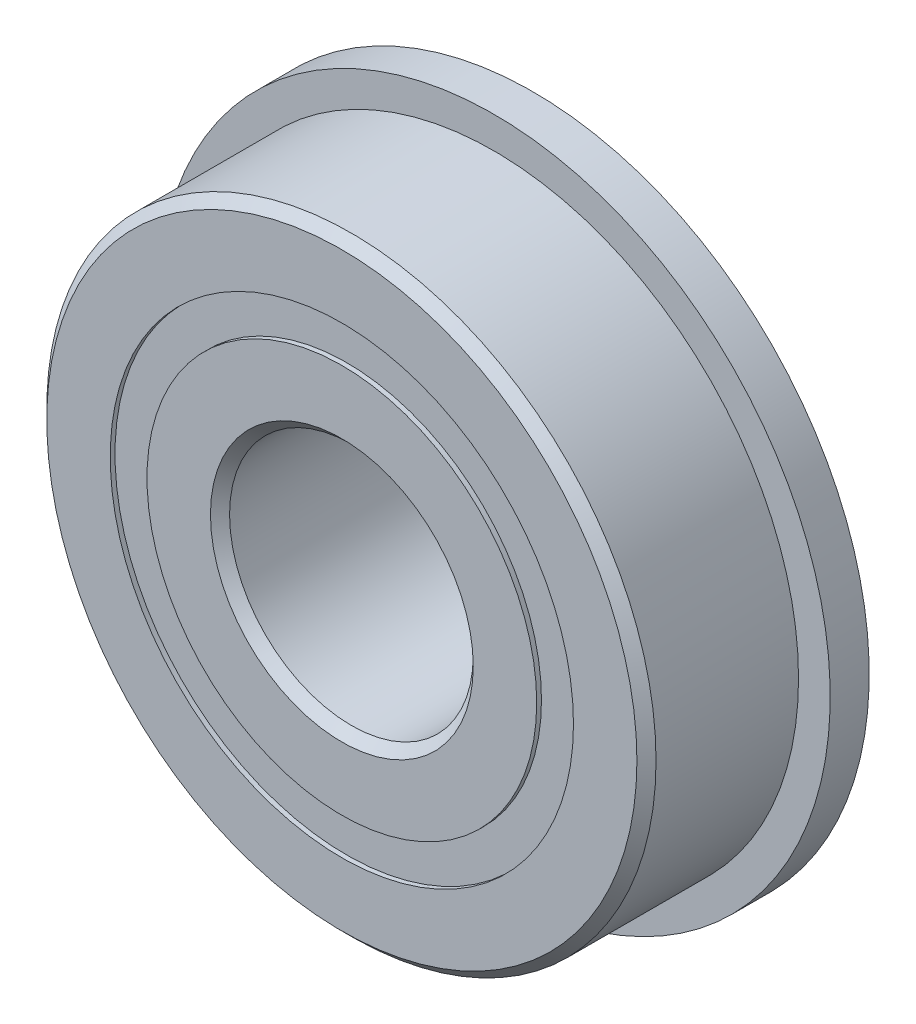
ISO-10303-21;
HEADER;
FILE_DESCRIPTION(('STEP AP214'),'2;1');
FILE_NAME('part.step','',(''),(''),'','','');
FILE_SCHEMA(('AUTOMOTIVE_DESIGN { 1 0 10303 214 1 1 1 1 }'));
ENDSEC;
DATA;
#1=APPLICATION_CONTEXT('core data for automotive mechanical design processes');
#2=APPLICATION_PROTOCOL_DEFINITION('international standard','automotive_design',2000,#1);
#3=PRODUCT_CONTEXT('',#1,'mechanical');
#4=PRODUCT('Part','Part','',(#3));
#5=PRODUCT_RELATED_PRODUCT_CATEGORY('part','',(#4));
#6=PRODUCT_DEFINITION_FORMATION('','',#4);
#7=PRODUCT_DEFINITION_CONTEXT('part definition',#1,'design');
#8=PRODUCT_DEFINITION('design','',#6,#7);
#9=PRODUCT_DEFINITION_SHAPE('','',#8);
#10=(LENGTH_UNIT() NAMED_UNIT(*) SI_UNIT(.MILLI.,.METRE.));
#11=(NAMED_UNIT(*) PLANE_ANGLE_UNIT() SI_UNIT($,.RADIAN.));
#12=(NAMED_UNIT(*) SI_UNIT($,.STERADIAN.) SOLID_ANGLE_UNIT());
#13=UNCERTAINTY_MEASURE_WITH_UNIT(LENGTH_MEASURE(1.E-05),#10,'distance_accuracy_value','');
#14=(GEOMETRIC_REPRESENTATION_CONTEXT(3) GLOBAL_UNCERTAINTY_ASSIGNED_CONTEXT((#13)) GLOBAL_UNIT_ASSIGNED_CONTEXT((#10,
#11,#12)) REPRESENTATION_CONTEXT('',''));
#15=CARTESIAN_POINT('',(0.,0.,0.));
#16=DIRECTION('',(0.,0.,1.));
#17=DIRECTION('',(1.,0.,0.));
#18=AXIS2_PLACEMENT_3D('',#15,#16,#17);
#19=CARTESIAN_POINT('',(0.,6.03522142857143,-2.36474));
#20=DIRECTION('',(0.,0.,1.));
#21=DIRECTION('',(1.,0.,0.));
#22=AXIS2_PLACEMENT_3D('',#19,#20,#21);
#23=PLANE('',#22);
#24=CARTESIAN_POINT('',(0.,0.,-2.36474));
#25=DIRECTION('',(0.,0.,1.));
#26=DIRECTION('',(1.,0.,0.));
#27=AXIS2_PLACEMENT_3D('',#24,#25,#26);
#28=CIRCLE('',#27,6.03522142857143);
#29=CARTESIAN_POINT('',(6.03522142857143,0.,-2.36474));
#30=VERTEX_POINT('',#29);
#31=EDGE_CURVE('E55',#30,#30,#28,.T.);
#32=ORIENTED_EDGE('',*,*,#31,.F.);
#33=EDGE_LOOP('',(#32));
#34=FACE_BOUND('',#33,.T.);
#35=CARTESIAN_POINT('',(0.,0.,-2.36474));
#36=DIRECTION('',(0.,0.,1.));
#37=DIRECTION('',(1.,0.,0.));
#38=AXIS2_PLACEMENT_3D('',#35,#36,#37);
#39=CIRCLE('',#38,5.07727857142857);
#40=CARTESIAN_POINT('',(5.07727857142857,0.,-2.36474));
#41=VERTEX_POINT('',#40);
#42=EDGE_CURVE('E11',#41,#41,#39,.T.);
#43=ORIENTED_EDGE('',*,*,#42,.T.);
#44=EDGE_LOOP('',(#43));
#45=FACE_BOUND('',#44,.T.);
#46=ADVANCED_FACE('F41',(#34,#45),#23,.F.);
#47=CARTESIAN_POINT('',(0.,0.,2.4892));
#48=DIRECTION('',(0.,0.,1.));
#49=DIRECTION('',(1.,0.,0.));
#50=AXIS2_PLACEMENT_3D('',#47,#48,#49);
#51=CYLINDRICAL_SURFACE('',#50,5.07727857142857);
#52=ORIENTED_EDGE('',*,*,#42,.F.);
#53=EDGE_LOOP('',(#52));
#54=FACE_BOUND('',#53,.T.);
#55=CARTESIAN_POINT('',(0.,0.,-1.20554465033679));
#56=DIRECTION('',(0.,0.,1.));
#57=DIRECTION('',(1.,0.,0.));
#58=AXIS2_PLACEMENT_3D('',#55,#56,#57);
#59=CIRCLE('',#58,5.07727857142857);
#60=CARTESIAN_POINT('',(5.07727857142857,0.,-1.20554465033679));
#61=VERTEX_POINT('',#60);
#62=EDGE_CURVE('E47',#61,#61,#59,.T.);
#63=ORIENTED_EDGE('',*,*,#62,.T.);
#64=EDGE_LOOP('',(#63));
#65=FACE_BOUND('',#64,.T.);
#66=ADVANCED_FACE('F64',(#54,#65),#51,.F.);
#67=CARTESIAN_POINT('',(0.,6.03522142857143,-1.20554465033679));
#68=DIRECTION('',(0.,0.,-1.));
#69=DIRECTION('',(-1.,0.,0.));
#70=AXIS2_PLACEMENT_3D('',#67,#68,#69);
#71=PLANE('',#70);
#72=ORIENTED_EDGE('',*,*,#62,.F.);
#73=EDGE_LOOP('',(#72));
#74=FACE_BOUND('',#73,.T.);
#75=CARTESIAN_POINT('',(0.,0.,-1.20554465033679));
#76=DIRECTION('',(0.,0.,1.));
#77=DIRECTION('',(1.,0.,0.));
#78=AXIS2_PLACEMENT_3D('',#75,#76,#77);
#79=CIRCLE('',#78,6.03522142857143);
#80=CARTESIAN_POINT('',(6.03522142857143,0.,-1.20554465033679));
#81=VERTEX_POINT('',#80);
#82=EDGE_CURVE('E51',#81,#81,#79,.T.);
#83=ORIENTED_EDGE('',*,*,#82,.T.);
#84=EDGE_LOOP('',(#83));
#85=FACE_BOUND('',#84,.T.);
#86=ADVANCED_FACE('F68',(#74,#85),#71,.F.);
#87=CARTESIAN_POINT('',(0.,0.,2.4892));
#88=DIRECTION('',(0.,0.,1.));
#89=DIRECTION('',(1.,0.,0.));
#90=AXIS2_PLACEMENT_3D('',#87,#88,#89);
#91=CYLINDRICAL_SURFACE('',#90,6.03522142857143);
#92=ORIENTED_EDGE('',*,*,#82,.F.);
#93=EDGE_LOOP('',(#92));
#94=FACE_BOUND('',#93,.T.);
#95=ORIENTED_EDGE('',*,*,#31,.T.);
#96=EDGE_LOOP('',(#95));
#97=FACE_BOUND('',#96,.T.);
#98=ADVANCED_FACE('F61',(#94,#97),#91,.T.);
#99=CLOSED_SHELL('',(#46,#66,#86,#98));
#100=MANIFOLD_SOLID_BREP('B2',#99);
#101=CARTESIAN_POINT('',(0.,6.03522142857143,2.36474));
#102=DIRECTION('',(0.,0.,-1.));
#103=DIRECTION('',(-1.,0.,0.));
#104=AXIS2_PLACEMENT_3D('',#101,#102,#103);
#105=PLANE('',#104);
#106=CARTESIAN_POINT('',(0.,0.,2.36474));
#107=DIRECTION('',(0.,0.,1.));
#108=DIRECTION('',(1.,0.,0.));
#109=AXIS2_PLACEMENT_3D('',#106,#107,#108);
#110=CIRCLE('',#109,5.07727857142857);
#111=CARTESIAN_POINT('',(5.07727857142857,0.,2.36474));
#112=VERTEX_POINT('',#111);
#113=EDGE_CURVE('E40',#112,#112,#110,.T.);
#114=ORIENTED_EDGE('',*,*,#113,.F.);
#115=EDGE_LOOP('',(#114));
#116=FACE_BOUND('',#115,.T.);
#117=CARTESIAN_POINT('',(0.,0.,2.36474));
#118=DIRECTION('',(0.,0.,1.));
#119=DIRECTION('',(1.,0.,0.));
#120=AXIS2_PLACEMENT_3D('',#117,#118,#119);
#121=CIRCLE('',#120,6.03522142857143);
#122=CARTESIAN_POINT('',(6.03522142857143,0.,2.36474));
#123=VERTEX_POINT('',#122);
#124=EDGE_CURVE('E122',#123,#123,#121,.T.);
#125=ORIENTED_EDGE('',*,*,#124,.T.);
#126=EDGE_LOOP('',(#125));
#127=FACE_BOUND('',#126,.T.);
#128=ADVANCED_FACE('F108',(#116,#127),#105,.F.);
#129=CARTESIAN_POINT('',(0.,0.,2.4892));
#130=DIRECTION('',(0.,0.,1.));
#131=DIRECTION('',(1.,0.,0.));
#132=AXIS2_PLACEMENT_3D('',#129,#130,#131);
#133=CYLINDRICAL_SURFACE('',#132,5.07727857142857);
#134=CARTESIAN_POINT('',(0.,0.,1.20554465033679));
#135=DIRECTION('',(0.,0.,1.));
#136=DIRECTION('',(1.,0.,0.));
#137=AXIS2_PLACEMENT_3D('',#134,#135,#136);
#138=CIRCLE('',#137,5.07727857142857);
#139=CARTESIAN_POINT('',(5.07727857142857,0.,1.20554465033679));
#140=VERTEX_POINT('',#139);
#141=EDGE_CURVE('E114',#140,#140,#138,.T.);
#142=ORIENTED_EDGE('',*,*,#141,.F.);
#143=EDGE_LOOP('',(#142));
#144=FACE_BOUND('',#143,.T.);
#145=ORIENTED_EDGE('',*,*,#113,.T.);
#146=EDGE_LOOP('',(#145));
#147=FACE_BOUND('',#146,.T.);
#148=ADVANCED_FACE('F137',(#144,#147),#133,.F.);
#149=CARTESIAN_POINT('',(0.,6.03522142857143,1.20554465033679));
#150=DIRECTION('',(0.,0.,1.));
#151=DIRECTION('',(1.,0.,0.));
#152=AXIS2_PLACEMENT_3D('',#149,#150,#151);
#153=PLANE('',#152);
#154=CARTESIAN_POINT('',(0.,0.,1.20554465033679));
#155=DIRECTION('',(0.,0.,1.));
#156=DIRECTION('',(1.,0.,0.));
#157=AXIS2_PLACEMENT_3D('',#154,#155,#156);
#158=CIRCLE('',#157,6.03522142857143);
#159=CARTESIAN_POINT('',(6.03522142857143,0.,1.20554465033679));
#160=VERTEX_POINT('',#159);
#161=EDGE_CURVE('E118',#160,#160,#158,.T.);
#162=ORIENTED_EDGE('',*,*,#161,.F.);
#163=EDGE_LOOP('',(#162));
#164=FACE_BOUND('',#163,.T.);
#165=ORIENTED_EDGE('',*,*,#141,.T.);
#166=EDGE_LOOP('',(#165));
#167=FACE_BOUND('',#166,.T.);
#168=ADVANCED_FACE('F132',(#164,#167),#153,.F.);
#169=CARTESIAN_POINT('',(0.,0.,2.4892));
#170=DIRECTION('',(0.,0.,1.));
#171=DIRECTION('',(1.,0.,0.));
#172=AXIS2_PLACEMENT_3D('',#169,#170,#171);
#173=CYLINDRICAL_SURFACE('',#172,6.03522142857143);
#174=ORIENTED_EDGE('',*,*,#124,.F.);
#175=EDGE_LOOP('',(#174));
#176=FACE_BOUND('',#175,.T.);
#177=ORIENTED_EDGE('',*,*,#161,.T.);
#178=EDGE_LOOP('',(#177));
#179=FACE_BOUND('',#178,.T.);
#180=ADVANCED_FACE('F129',(#176,#179),#173,.T.);
#181=CLOSED_SHELL('',(#128,#148,#168,#180));
#182=MANIFOLD_SOLID_BREP('B6',#181);
#183=CARTESIAN_POINT('',(-2.41076652547187,5.00600827228285,0.));
#184=DIRECTION('',(0.,0.,1.));
#185=DIRECTION('',(-0.433883739117546,0.900968867902425,0.));
#186=AXIS2_PLACEMENT_3D('',#183,#184,#185);
#187=SPHERICAL_SURFACE('',#186,1.20554465033679);
#188=CARTESIAN_POINT('',(-2.41076652547187,5.00600827228285,1.20554465033679));
#189=VERTEX_POINT('',#188);
#190=VERTEX_LOOP('',#189);
#191=FACE_BOUND('',#190,.T.);
#192=ADVANCED_FACE('F175',(#191),#187,.T.);
#193=CLOSED_SHELL('',(#192));
#194=MANIFOLD_SOLID_BREP('B35',#193);
#195=CARTESIAN_POINT('',(-4.34405117446295,3.46426521157764,0.));
#196=DIRECTION('',(0.,0.,1.));
#197=DIRECTION('',(-0.781831482468022,0.623489801858743,0.));
#198=AXIS2_PLACEMENT_3D('',#195,#196,#197);
#199=SPHERICAL_SURFACE('',#198,1.20554465033679);
#200=CARTESIAN_POINT('',(-4.34405117446295,3.46426521157764,1.20554465033679));
#201=VERTEX_POINT('',#200);
#202=VERTEX_LOOP('',#201);
#203=FACE_BOUND('',#202,.T.);
#204=ADVANCED_FACE('F195',(#203),#199,.T.);
#205=CLOSED_SHELL('',(#204));
#206=MANIFOLD_SOLID_BREP('B104',#205);
#207=CARTESIAN_POINT('',(-5.41694321206024,1.23638193929483,0.));
#208=DIRECTION('',(0.,0.,1.));
#209=DIRECTION('',(-0.974927912181821,0.222520933956325,0.));
#210=AXIS2_PLACEMENT_3D('',#207,#208,#209);
#211=SPHERICAL_SURFACE('',#210,1.20554465033679);
#212=CARTESIAN_POINT('',(-5.41694321206024,1.23638193929483,1.20554465033679));
#213=VERTEX_POINT('',#212);
#214=VERTEX_LOOP('',#213);
#215=FACE_BOUND('',#214,.T.);
#216=ADVANCED_FACE('F215',(#215),#211,.T.);
#217=CLOSED_SHELL('',(#216));
#218=MANIFOLD_SOLID_BREP('B171',#217);
#219=CARTESIAN_POINT('',(-5.41694321206027,-1.23638193929472,0.));
#220=DIRECTION('',(0.,0.,1.));
#221=DIRECTION('',(-0.974927912181826,-0.222520933956305,0.));
#222=AXIS2_PLACEMENT_3D('',#219,#220,#221);
#223=SPHERICAL_SURFACE('',#222,1.20554465033679);
#224=CARTESIAN_POINT('',(-5.41694321206027,-1.23638193929472,1.20554465033679));
#225=VERTEX_POINT('',#224);
#226=VERTEX_LOOP('',#225);
#227=FACE_BOUND('',#226,.T.);
#228=ADVANCED_FACE('F235',(#227),#223,.T.);
#229=CLOSED_SHELL('',(#228));
#230=MANIFOLD_SOLID_BREP('B191',#229);
#231=CARTESIAN_POINT('',(-4.34405117446302,-3.46426521157755,0.));
#232=DIRECTION('',(0.,0.,1.));
#233=DIRECTION('',(-0.781831482468035,-0.623489801858727,0.));
#234=AXIS2_PLACEMENT_3D('',#231,#232,#233);
#235=SPHERICAL_SURFACE('',#234,1.20554465033679);
#236=CARTESIAN_POINT('',(-4.34405117446302,-3.46426521157755,1.20554465033679));
#237=VERTEX_POINT('',#236);
#238=VERTEX_LOOP('',#237);
#239=FACE_BOUND('',#238,.T.);
#240=ADVANCED_FACE('F255',(#239),#235,.T.);
#241=CLOSED_SHELL('',(#240));
#242=MANIFOLD_SOLID_BREP('B211',#241);
#243=CARTESIAN_POINT('',(-2.41076652547197,-5.0060082722828,0.));
#244=DIRECTION('',(0.,0.,1.));
#245=DIRECTION('',(-0.433883739117565,-0.900968867902416,0.));
#246=AXIS2_PLACEMENT_3D('',#243,#244,#245);
#247=SPHERICAL_SURFACE('',#246,1.20554465033679);
#248=CARTESIAN_POINT('',(-2.41076652547197,-5.0060082722828,1.20554465033679));
#249=VERTEX_POINT('',#248);
#250=VERTEX_LOOP('',#249);
#251=FACE_BOUND('',#250,.T.);
#252=ADVANCED_FACE('F275',(#251),#247,.T.);
#253=CLOSED_SHELL('',(#252));
#254=MANIFOLD_SOLID_BREP('B231',#253);
#255=CARTESIAN_POINT('',(0.,-5.55625,0.));
#256=DIRECTION('',(0.,0.,1.));
#257=DIRECTION('',(0.,-1.,0.));
#258=AXIS2_PLACEMENT_3D('',#255,#256,#257);
#259=SPHERICAL_SURFACE('',#258,1.20554465033679);
#260=CARTESIAN_POINT('',(0.,-5.55625,1.20554465033679));
#261=VERTEX_POINT('',#260);
#262=VERTEX_LOOP('',#261);
#263=FACE_BOUND('',#262,.T.);
#264=ADVANCED_FACE('F295',(#263),#259,.T.);
#265=CLOSED_SHELL('',(#264));
#266=MANIFOLD_SOLID_BREP('B251',#265);
#267=CARTESIAN_POINT('',(2.4107665254719,-5.00600827228283,0.));
#268=DIRECTION('',(0.,0.,1.));
#269=DIRECTION('',(0.433883739117553,-0.900968867902422,0.));
#270=AXIS2_PLACEMENT_3D('',#267,#268,#269);
#271=SPHERICAL_SURFACE('',#270,1.20554465033679);
#272=CARTESIAN_POINT('',(2.4107665254719,-5.00600827228283,1.20554465033679));
#273=VERTEX_POINT('',#272);
#274=VERTEX_LOOP('',#273);
#275=FACE_BOUND('',#274,.T.);
#276=ADVANCED_FACE('F315',(#275),#271,.T.);
#277=CLOSED_SHELL('',(#276));
#278=MANIFOLD_SOLID_BREP('B271',#277);
#279=CARTESIAN_POINT('',(4.34405117446297,-3.46426521157761,0.));
#280=DIRECTION('',(0.,0.,1.));
#281=DIRECTION('',(0.781831482468027,-0.623489801858737,0.));
#282=AXIS2_PLACEMENT_3D('',#279,#280,#281);
#283=SPHERICAL_SURFACE('',#282,1.20554465033679);
#284=CARTESIAN_POINT('',(4.34405117446297,-3.46426521157761,1.20554465033679));
#285=VERTEX_POINT('',#284);
#286=VERTEX_LOOP('',#285);
#287=FACE_BOUND('',#286,.T.);
#288=ADVANCED_FACE('F335',(#287),#283,.T.);
#289=CLOSED_SHELL('',(#288));
#290=MANIFOLD_SOLID_BREP('B291',#289);
#291=CARTESIAN_POINT('',(5.41694321206025,-1.23638193929479,0.));
#292=DIRECTION('',(0.,0.,1.));
#293=DIRECTION('',(0.974927912181823,-0.222520933956318,0.));
#294=AXIS2_PLACEMENT_3D('',#291,#292,#293);
#295=SPHERICAL_SURFACE('',#294,1.20554465033679);
#296=CARTESIAN_POINT('',(5.41694321206025,-1.23638193929479,1.20554465033679));
#297=VERTEX_POINT('',#296);
#298=VERTEX_LOOP('',#297);
#299=FACE_BOUND('',#298,.T.);
#300=ADVANCED_FACE('F355',(#299),#295,.T.);
#301=CLOSED_SHELL('',(#300));
#302=MANIFOLD_SOLID_BREP('B311',#301);
#303=CARTESIAN_POINT('',(5.41694321206026,1.23638193929476,0.));
#304=DIRECTION('',(0.,0.,1.));
#305=DIRECTION('',(0.974927912181824,0.222520933956311,0.));
#306=AXIS2_PLACEMENT_3D('',#303,#304,#305);
#307=SPHERICAL_SURFACE('',#306,1.20554465033679);
#308=CARTESIAN_POINT('',(5.41694321206026,1.23638193929476,1.20554465033679));
#309=VERTEX_POINT('',#308);
#310=VERTEX_LOOP('',#309);
#311=FACE_BOUND('',#310,.T.);
#312=ADVANCED_FACE('F375',(#311),#307,.T.);
#313=CLOSED_SHELL('',(#312));
#314=MANIFOLD_SOLID_BREP('B331',#313);
#315=CARTESIAN_POINT('',(4.344051174463,3.46426521157758,0.));
#316=DIRECTION('',(0.,0.,1.));
#317=DIRECTION('',(0.781831482468031,0.623489801858732,0.));
#318=AXIS2_PLACEMENT_3D('',#315,#316,#317);
#319=SPHERICAL_SURFACE('',#318,1.20554465033679);
#320=CARTESIAN_POINT('',(4.344051174463,3.46426521157758,1.20554465033679));
#321=VERTEX_POINT('',#320);
#322=VERTEX_LOOP('',#321);
#323=FACE_BOUND('',#322,.T.);
#324=ADVANCED_FACE('F395',(#323),#319,.T.);
#325=CLOSED_SHELL('',(#324));
#326=MANIFOLD_SOLID_BREP('B351',#325);
#327=CARTESIAN_POINT('',(2.41076652547194,5.00600827228281,0.));
#328=DIRECTION('',(0.,0.,1.));
#329=DIRECTION('',(0.433883739117559,0.900968867902419,0.));
#330=AXIS2_PLACEMENT_3D('',#327,#328,#329);
#331=SPHERICAL_SURFACE('',#330,1.20554465033679);
#332=CARTESIAN_POINT('',(2.41076652547194,5.00600827228281,1.20554465033679));
#333=VERTEX_POINT('',#332);
#334=VERTEX_LOOP('',#333);
#335=FACE_BOUND('',#334,.T.);
#336=ADVANCED_FACE('F415',(#335),#331,.T.);
#337=CLOSED_SHELL('',(#336));
#338=MANIFOLD_SOLID_BREP('B371',#337);
#339=CARTESIAN_POINT('',(0.,5.55625,0.));
#340=DIRECTION('',(0.,0.,1.));
#341=DIRECTION('',(0.,1.,0.));
#342=AXIS2_PLACEMENT_3D('',#339,#340,#341);
#343=SPHERICAL_SURFACE('',#342,1.20554465033679);
#344=CARTESIAN_POINT('',(0.,5.55625,1.20554465033679));
#345=VERTEX_POINT('',#344);
#346=VERTEX_LOOP('',#345);
#347=FACE_BOUND('',#346,.T.);
#348=ADVANCED_FACE('F437',(#347),#343,.T.);
#349=CLOSED_SHELL('',(#348));
#350=MANIFOLD_SOLID_BREP('B391',#349);
#351=CARTESIAN_POINT('',(0.,5.07727857142857,2.4892));
#352=DIRECTION('',(0.,0.,-1.));
#353=DIRECTION('',(-1.,0.,0.));
#354=AXIS2_PLACEMENT_3D('',#351,#352,#353);
#355=PLANE('',#354);
#356=CARTESIAN_POINT('',(0.,0.,2.4892));
#357=DIRECTION('',(0.,0.,1.));
#358=DIRECTION('',(1.,0.,0.));
#359=AXIS2_PLACEMENT_3D('',#356,#357,#358);
#360=CIRCLE('',#359,3.42392);
#361=CARTESIAN_POINT('',(3.42392,0.,2.4892));
#362=VERTEX_POINT('',#361);
#363=EDGE_CURVE('E484',#362,#362,#360,.T.);
#364=ORIENTED_EDGE('',*,*,#363,.F.);
#365=EDGE_LOOP('',(#364));
#366=FACE_BOUND('',#365,.T.);
#367=CARTESIAN_POINT('',(0.,0.,2.4892));
#368=DIRECTION('',(0.,0.,1.));
#369=DIRECTION('',(1.,0.,0.));
#370=AXIS2_PLACEMENT_3D('',#367,#368,#369);
#371=CIRCLE('',#370,5.07727857142857);
#372=CARTESIAN_POINT('',(5.07727857142857,0.,2.4892));
#373=VERTEX_POINT('',#372);
#374=EDGE_CURVE('E436',#373,#373,#371,.T.);
#375=ORIENTED_EDGE('',*,*,#374,.T.);
#376=EDGE_LOOP('',(#375));
#377=FACE_BOUND('',#376,.T.);
#378=ADVANCED_FACE('F456',(#366,#377),#355,.F.);
#379=CARTESIAN_POINT('',(0.,0.,2.4892));
#380=DIRECTION('',(0.,0.,1.));
#381=DIRECTION('',(1.,0.,0.));
#382=AXIS2_PLACEMENT_3D('',#379,#380,#381);
#383=CYLINDRICAL_SURFACE('',#382,5.07727857142857);
#384=ORIENTED_EDGE('',*,*,#374,.F.);
#385=EDGE_LOOP('',(#384));
#386=FACE_BOUND('',#385,.T.);
#387=CARTESIAN_POINT('',(0.,0.,1.10631111111111));
#388=DIRECTION('',(0.,0.,1.));
#389=DIRECTION('',(1.,0.,0.));
#390=AXIS2_PLACEMENT_3D('',#387,#388,#389);
#391=CIRCLE('',#390,5.07727857142857);
#392=CARTESIAN_POINT('',(5.07727857142857,0.,1.10631111111111));
#393=VERTEX_POINT('',#392);
#394=EDGE_CURVE('E462',#393,#393,#391,.T.);
#395=ORIENTED_EDGE('',*,*,#394,.T.);
#396=EDGE_LOOP('',(#395));
#397=FACE_BOUND('',#396,.T.);
#398=ADVANCED_FACE('F491',(#386,#397),#383,.T.);
#399=CARTESIAN_POINT('',(0.,0.,0.));
#400=DIRECTION('',(0.,0.,1.));
#401=DIRECTION('',(1.,0.,0.));
#402=AXIS2_PLACEMENT_3D('',#399,#400,#401);
#403=TOROIDAL_SURFACE('',#402,5.55625,1.20554465033679);
#404=ORIENTED_EDGE('',*,*,#394,.F.);
#405=EDGE_LOOP('',(#404));
#406=FACE_BOUND('',#405,.T.);
#407=CARTESIAN_POINT('',(0.,0.,-1.10631111111111));
#408=DIRECTION('',(0.,0.,1.));
#409=DIRECTION('',(1.,0.,0.));
#410=AXIS2_PLACEMENT_3D('',#407,#408,#409);
#411=CIRCLE('',#410,5.07727857142857);
#412=CARTESIAN_POINT('',(5.07727857142857,0.,-1.10631111111111));
#413=VERTEX_POINT('',#412);
#414=EDGE_CURVE('E466',#413,#413,#411,.T.);
#415=ORIENTED_EDGE('',*,*,#414,.T.);
#416=EDGE_LOOP('',(#415));
#417=FACE_BOUND('',#416,.T.);
#418=ADVANCED_FACE('F495',(#406,#417),#403,.F.);
#419=CARTESIAN_POINT('',(0.,0.,2.4892));
#420=DIRECTION('',(0.,0.,1.));
#421=DIRECTION('',(1.,0.,0.));
#422=AXIS2_PLACEMENT_3D('',#419,#420,#421);
#423=CYLINDRICAL_SURFACE('',#422,5.07727857142857);
#424=ORIENTED_EDGE('',*,*,#414,.F.);
#425=EDGE_LOOP('',(#424));
#426=FACE_BOUND('',#425,.T.);
#427=CARTESIAN_POINT('',(0.,0.,-2.4892));
#428=DIRECTION('',(0.,0.,1.));
#429=DIRECTION('',(1.,0.,0.));
#430=AXIS2_PLACEMENT_3D('',#427,#428,#429);
#431=CIRCLE('',#430,5.07727857142857);
#432=CARTESIAN_POINT('',(5.07727857142857,0.,-2.4892));
#433=VERTEX_POINT('',#432);
#434=EDGE_CURVE('E470',#433,#433,#431,.T.);
#435=ORIENTED_EDGE('',*,*,#434,.T.);
#436=EDGE_LOOP('',(#435));
#437=FACE_BOUND('',#436,.T.);
#438=ADVANCED_FACE('F500',(#426,#437),#423,.T.);
#439=CARTESIAN_POINT('',(0.,3.42392,-2.4892));
#440=DIRECTION('',(0.,0.,1.));
#441=DIRECTION('',(1.,0.,0.));
#442=AXIS2_PLACEMENT_3D('',#439,#440,#441);
#443=PLANE('',#442);
#444=ORIENTED_EDGE('',*,*,#434,.F.);
#445=EDGE_LOOP('',(#444));
#446=FACE_BOUND('',#445,.T.);
#447=CARTESIAN_POINT('',(0.,0.,-2.4892));
#448=DIRECTION('',(0.,0.,1.));
#449=DIRECTION('',(1.,0.,0.));
#450=AXIS2_PLACEMENT_3D('',#447,#448,#449);
#451=CIRCLE('',#450,3.42392);
#452=CARTESIAN_POINT('',(3.42392,0.,-2.4892));
#453=VERTEX_POINT('',#452);
#454=EDGE_CURVE('E475',#453,#453,#451,.T.);
#455=ORIENTED_EDGE('',*,*,#454,.T.);
#456=EDGE_LOOP('',(#455));
#457=FACE_BOUND('',#456,.T.);
#458=ADVANCED_FACE('F506',(#446,#457),#443,.F.);
#459=CARTESIAN_POINT('',(0.,0.,-2.24028));
#460=DIRECTION('',(0.,0.,-1.));
#461=DIRECTION('',(-1.,0.,0.));
#462=AXIS2_PLACEMENT_3D('',#459,#460,#461);
#463=CONICAL_SURFACE('',#462,3.175,0.785398163397447);
#464=ORIENTED_EDGE('',*,*,#454,.F.);
#465=EDGE_LOOP('',(#464));
#466=FACE_BOUND('',#465,.T.);
#467=CARTESIAN_POINT('',(0.,0.,-2.24028));
#468=DIRECTION('',(0.,0.,1.));
#469=DIRECTION('',(1.,0.,0.));
#470=AXIS2_PLACEMENT_3D('',#467,#468,#469);
#471=CIRCLE('',#470,3.175);
#472=CARTESIAN_POINT('',(3.175,0.,-2.24028));
#473=VERTEX_POINT('',#472);
#474=EDGE_CURVE('E478',#473,#473,#471,.T.);
#475=ORIENTED_EDGE('',*,*,#474,.T.);
#476=EDGE_LOOP('',(#475));
#477=FACE_BOUND('',#476,.T.);
#478=ADVANCED_FACE('F510',(#466,#477),#463,.F.);
#479=CARTESIAN_POINT('',(0.,0.,2.4892));
#480=DIRECTION('',(0.,0.,1.));
#481=DIRECTION('',(1.,0.,0.));
#482=AXIS2_PLACEMENT_3D('',#479,#480,#481);
#483=CYLINDRICAL_SURFACE('',#482,3.175);
#484=ORIENTED_EDGE('',*,*,#474,.F.);
#485=EDGE_LOOP('',(#484));
#486=FACE_BOUND('',#485,.T.);
#487=CARTESIAN_POINT('',(0.,0.,2.24028));
#488=DIRECTION('',(0.,0.,1.));
#489=DIRECTION('',(1.,0.,0.));
#490=AXIS2_PLACEMENT_3D('',#487,#488,#489);
#491=CIRCLE('',#490,3.175);
#492=CARTESIAN_POINT('',(3.175,0.,2.24028));
#493=VERTEX_POINT('',#492);
#494=EDGE_CURVE('E481',#493,#493,#491,.T.);
#495=ORIENTED_EDGE('',*,*,#494,.T.);
#496=EDGE_LOOP('',(#495));
#497=FACE_BOUND('',#496,.T.);
#498=ADVANCED_FACE('F514',(#486,#497),#483,.F.);
#499=CARTESIAN_POINT('',(0.,0.,2.4892));
#500=DIRECTION('',(0.,0.,1.));
#501=DIRECTION('',(1.,0.,0.));
#502=AXIS2_PLACEMENT_3D('',#499,#500,#501);
#503=CONICAL_SURFACE('',#502,3.42392,0.785398163397452);
#504=ORIENTED_EDGE('',*,*,#494,.F.);
#505=EDGE_LOOP('',(#504));
#506=FACE_BOUND('',#505,.T.);
#507=ORIENTED_EDGE('',*,*,#363,.T.);
#508=EDGE_LOOP('',(#507));
#509=FACE_BOUND('',#508,.T.);
#510=ADVANCED_FACE('F488',(#506,#509),#503,.F.);
#511=CLOSED_SHELL('',(#378,#398,#418,#438,#458,#478,#498,#510));
#512=MANIFOLD_SOLID_BREP('B411',#511);
#513=CARTESIAN_POINT('',(0.,0.,2.24028));
#514=DIRECTION('',(0.,0.,-1.));
#515=DIRECTION('',(-1.,0.,0.));
#516=AXIS2_PLACEMENT_3D('',#513,#514,#515);
#517=CONICAL_SURFACE('',#516,7.9375,0.785398163397447);
#518=CARTESIAN_POINT('',(0.,0.,2.4892));
#519=DIRECTION('',(0.,0.,1.));
#520=DIRECTION('',(1.,0.,0.));
#521=AXIS2_PLACEMENT_3D('',#518,#519,#520);
#522=CIRCLE('',#521,7.68858);
#523=CARTESIAN_POINT('',(7.68858,0.,2.4892));
#524=VERTEX_POINT('',#523);
#525=EDGE_CURVE('E599',#524,#524,#522,.T.);
#526=ORIENTED_EDGE('',*,*,#525,.F.);
#527=EDGE_LOOP('',(#526));
#528=FACE_BOUND('',#527,.T.);
#529=CARTESIAN_POINT('',(0.,0.,2.24028));
#530=DIRECTION('',(0.,0.,1.));
#531=DIRECTION('',(1.,0.,0.));
#532=AXIS2_PLACEMENT_3D('',#529,#530,#531);
#533=CIRCLE('',#532,7.9375);
#534=CARTESIAN_POINT('',(7.9375,0.,2.24028));
#535=VERTEX_POINT('',#534);
#536=EDGE_CURVE('E455',#535,#535,#533,.T.);
#537=ORIENTED_EDGE('',*,*,#536,.T.);
#538=EDGE_LOOP('',(#537));
#539=FACE_BOUND('',#538,.T.);
#540=ADVANCED_FACE('F577',(#528,#539),#517,.T.);
#541=CARTESIAN_POINT('',(0.,0.,2.4892));
#542=DIRECTION('',(0.,0.,1.));
#543=DIRECTION('',(1.,0.,0.));
#544=AXIS2_PLACEMENT_3D('',#541,#542,#543);
#545=CYLINDRICAL_SURFACE('',#544,7.9375);
#546=CARTESIAN_POINT('',(0.,0.,-1.4732));
#547=DIRECTION('',(0.,0.,1.));
#548=DIRECTION('',(1.,0.,0.));
#549=AXIS2_PLACEMENT_3D('',#546,#547,#548);
#550=CIRCLE('',#549,7.9375);
#551=CARTESIAN_POINT('',(7.9375,0.,-1.4732));
#552=VERTEX_POINT('',#551);
#553=EDGE_CURVE('E602',#552,#552,#550,.T.);
#554=ORIENTED_EDGE('',*,*,#553,.T.);
#555=EDGE_LOOP('',(#554));
#556=FACE_BOUND('',#555,.T.);
#557=ORIENTED_EDGE('',*,*,#536,.F.);
#558=EDGE_LOOP('',(#557));
#559=FACE_BOUND('',#558,.T.);
#560=ADVANCED_FACE('F622',(#556,#559),#545,.T.);
#561=CARTESIAN_POINT('',(0.,7.68858,-2.4892));
#562=DIRECTION('',(0.,0.,1.));
#563=DIRECTION('',(1.,0.,0.));
#564=AXIS2_PLACEMENT_3D('',#561,#562,#563);
#565=PLANE('',#564);
#566=CARTESIAN_POINT('',(0.,0.,-2.4892));
#567=DIRECTION('',(0.,0.,1.));
#568=DIRECTION('',(1.,0.,0.));
#569=AXIS2_PLACEMENT_3D('',#566,#567,#568);
#570=CIRCLE('',#569,6.03522142857143);
#571=CARTESIAN_POINT('',(6.03522142857143,0.,-2.4892));
#572=VERTEX_POINT('',#571);
#573=EDGE_CURVE('E583',#572,#572,#570,.T.);
#574=ORIENTED_EDGE('',*,*,#573,.T.);
#575=EDGE_LOOP('',(#574));
#576=FACE_BOUND('',#575,.T.);
#577=CARTESIAN_POINT('',(0.,0.,-2.4892));
#578=DIRECTION('',(0.,0.,-1.));
#579=DIRECTION('',(-1.,0.,0.));
#580=AXIS2_PLACEMENT_3D('',#577,#578,#579);
#581=CIRCLE('',#580,8.763);
#582=CARTESIAN_POINT('',(-8.763,0.,-2.4892));
#583=VERTEX_POINT('',#582);
#584=EDGE_CURVE('E605',#583,#583,#581,.T.);
#585=ORIENTED_EDGE('',*,*,#584,.T.);
#586=EDGE_LOOP('',(#585));
#587=FACE_BOUND('',#586,.T.);
#588=ADVANCED_FACE('F625',(#576,#587),#565,.F.);
#589=CARTESIAN_POINT('',(0.,0.,2.4892));
#590=DIRECTION('',(0.,0.,1.));
#591=DIRECTION('',(1.,0.,0.));
#592=AXIS2_PLACEMENT_3D('',#589,#590,#591);
#593=CYLINDRICAL_SURFACE('',#592,6.03522142857143);
#594=CARTESIAN_POINT('',(0.,0.,-1.10631111111111));
#595=DIRECTION('',(0.,0.,1.));
#596=DIRECTION('',(1.,0.,0.));
#597=AXIS2_PLACEMENT_3D('',#594,#595,#596);
#598=CIRCLE('',#597,6.03522142857143);
#599=CARTESIAN_POINT('',(6.03522142857143,0.,-1.10631111111111));
#600=VERTEX_POINT('',#599);
#601=EDGE_CURVE('E587',#600,#600,#598,.T.);
#602=ORIENTED_EDGE('',*,*,#601,.T.);
#603=EDGE_LOOP('',(#602));
#604=FACE_BOUND('',#603,.T.);
#605=ORIENTED_EDGE('',*,*,#573,.F.);
#606=EDGE_LOOP('',(#605));
#607=FACE_BOUND('',#606,.T.);
#608=ADVANCED_FACE('F630',(#604,#607),#593,.F.);
#609=CARTESIAN_POINT('',(0.,0.,0.));
#610=DIRECTION('',(0.,0.,1.));
#611=DIRECTION('',(1.,0.,0.));
#612=AXIS2_PLACEMENT_3D('',#609,#610,#611);
#613=TOROIDAL_SURFACE('',#612,5.55625,1.20554465033679);
#614=ORIENTED_EDGE('',*,*,#601,.F.);
#615=EDGE_LOOP('',(#614));
#616=FACE_BOUND('',#615,.T.);
#617=CARTESIAN_POINT('',(0.,0.,1.10631111111111));
#618=DIRECTION('',(0.,0.,1.));
#619=DIRECTION('',(1.,0.,0.));
#620=AXIS2_PLACEMENT_3D('',#617,#618,#619);
#621=CIRCLE('',#620,6.03522142857143);
#622=CARTESIAN_POINT('',(6.03522142857143,0.,1.10631111111111));
#623=VERTEX_POINT('',#622);
#624=EDGE_CURVE('E591',#623,#623,#621,.T.);
#625=ORIENTED_EDGE('',*,*,#624,.T.);
#626=EDGE_LOOP('',(#625));
#627=FACE_BOUND('',#626,.T.);
#628=ADVANCED_FACE('F636',(#616,#627),#613,.F.);
#629=CARTESIAN_POINT('',(0.,0.,2.4892));
#630=DIRECTION('',(0.,0.,1.));
#631=DIRECTION('',(1.,0.,0.));
#632=AXIS2_PLACEMENT_3D('',#629,#630,#631);
#633=CYLINDRICAL_SURFACE('',#632,6.03522142857143);
#634=ORIENTED_EDGE('',*,*,#624,.F.);
#635=EDGE_LOOP('',(#634));
#636=FACE_BOUND('',#635,.T.);
#637=CARTESIAN_POINT('',(0.,0.,2.4892));
#638=DIRECTION('',(0.,0.,1.));
#639=DIRECTION('',(1.,0.,0.));
#640=AXIS2_PLACEMENT_3D('',#637,#638,#639);
#641=CIRCLE('',#640,6.03522142857143);
#642=CARTESIAN_POINT('',(6.03522142857143,0.,2.4892));
#643=VERTEX_POINT('',#642);
#644=EDGE_CURVE('E596',#643,#643,#641,.T.);
#645=ORIENTED_EDGE('',*,*,#644,.T.);
#646=EDGE_LOOP('',(#645));
#647=FACE_BOUND('',#646,.T.);
#648=ADVANCED_FACE('F640',(#636,#647),#633,.F.);
#649=CARTESIAN_POINT('',(0.,7.68858,2.4892));
#650=DIRECTION('',(0.,0.,-1.));
#651=DIRECTION('',(-1.,0.,0.));
#652=AXIS2_PLACEMENT_3D('',#649,#650,#651);
#653=PLANE('',#652);
#654=ORIENTED_EDGE('',*,*,#644,.F.);
#655=EDGE_LOOP('',(#654));
#656=FACE_BOUND('',#655,.T.);
#657=ORIENTED_EDGE('',*,*,#525,.T.);
#658=EDGE_LOOP('',(#657));
#659=FACE_BOUND('',#658,.T.);
#660=ADVANCED_FACE('F618',(#656,#659),#653,.F.);
#661=CARTESIAN_POINT('',(0.,6.03522142857143,-1.4732));
#662=DIRECTION('',(0.,0.,1.));
#663=DIRECTION('',(1.,0.,0.));
#664=AXIS2_PLACEMENT_3D('',#661,#662,#663);
#665=PLANE('',#664);
#666=CARTESIAN_POINT('',(0.,0.,-1.4732));
#667=DIRECTION('',(0.,0.,-1.));
#668=DIRECTION('',(-1.,0.,0.));
#669=AXIS2_PLACEMENT_3D('',#666,#667,#668);
#670=CIRCLE('',#669,8.763);
#671=CARTESIAN_POINT('',(-8.763,0.,-1.4732));
#672=VERTEX_POINT('',#671);
#673=EDGE_CURVE('E608',#672,#672,#670,.T.);
#674=ORIENTED_EDGE('',*,*,#673,.F.);
#675=EDGE_LOOP('',(#674));
#676=FACE_BOUND('',#675,.T.);
#677=ORIENTED_EDGE('',*,*,#553,.F.);
#678=EDGE_LOOP('',(#677));
#679=FACE_BOUND('',#678,.T.);
#680=ADVANCED_FACE('F615',(#676,#679),#665,.T.);
#681=CARTESIAN_POINT('',(0.,0.,-2.4892));
#682=DIRECTION('',(0.,0.,-1.));
#683=DIRECTION('',(-1.,0.,0.));
#684=AXIS2_PLACEMENT_3D('',#681,#682,#683);
#685=CYLINDRICAL_SURFACE('',#684,8.763);
#686=ORIENTED_EDGE('',*,*,#673,.T.);
#687=EDGE_LOOP('',(#686));
#688=FACE_BOUND('',#687,.T.);
#689=ORIENTED_EDGE('',*,*,#584,.F.);
#690=EDGE_LOOP('',(#689));
#691=FACE_BOUND('',#690,.T.);
#692=ADVANCED_FACE('F612',(#688,#691),#685,.T.);
#693=CLOSED_SHELL('',(#540,#560,#588,#608,#628,#648,#660,#680,#692));
#694=MANIFOLD_SOLID_BREP('B431',#693);
#695=ADVANCED_BREP_SHAPE_REPRESENTATION('',(#18,#100,#182,#194,#206,#218,#230,#242,#254,#266,
#278,#290,#302,#314,#326,#338,#350,#512,#694),#14);
#696=SHAPE_DEFINITION_REPRESENTATION(#9,#695);
ENDSEC;
END-ISO-10303-21;
